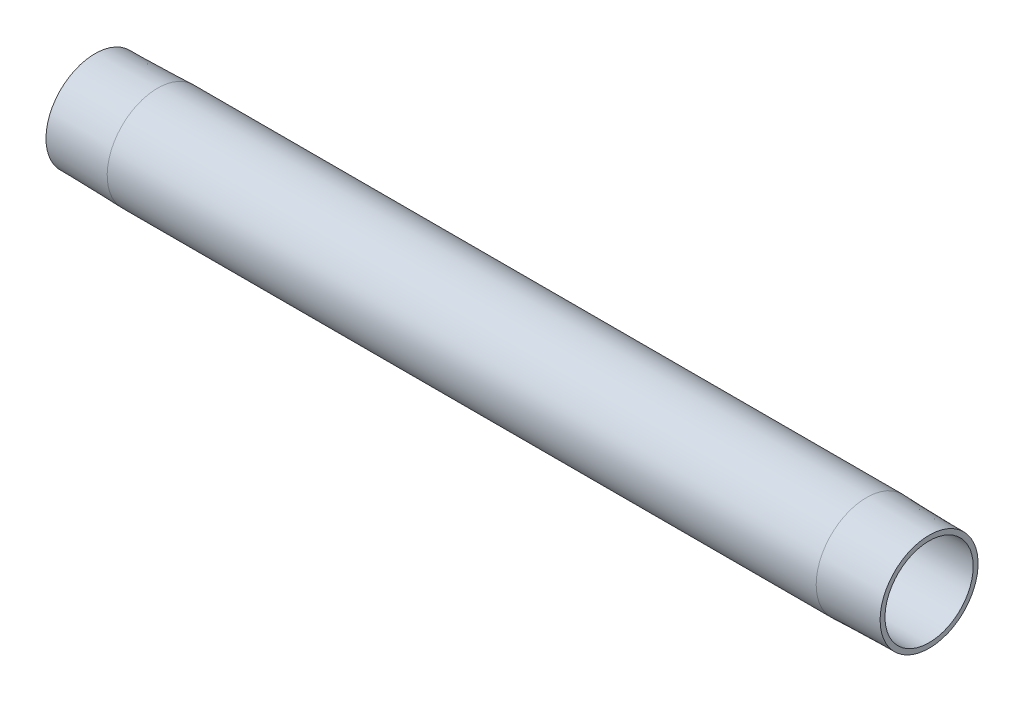
ISO-10303-21;
HEADER;
FILE_DESCRIPTION(('STEP AP214'),'2;1');
FILE_NAME('part.step','',(''),(''),'','','');
FILE_SCHEMA(('AUTOMOTIVE_DESIGN { 1 0 10303 214 1 1 1 1 }'));
ENDSEC;
DATA;
#1=APPLICATION_CONTEXT('core data for automotive mechanical design processes');
#2=APPLICATION_PROTOCOL_DEFINITION('international standard','automotive_design',2000,#1);
#3=PRODUCT_CONTEXT('',#1,'mechanical');
#4=PRODUCT('Part','Part','',(#3));
#5=PRODUCT_RELATED_PRODUCT_CATEGORY('part','',(#4));
#6=PRODUCT_DEFINITION_FORMATION('','',#4);
#7=PRODUCT_DEFINITION_CONTEXT('part definition',#1,'design');
#8=PRODUCT_DEFINITION('design','',#6,#7);
#9=PRODUCT_DEFINITION_SHAPE('','',#8);
#10=(LENGTH_UNIT() NAMED_UNIT(*) SI_UNIT(.MILLI.,.METRE.));
#11=(NAMED_UNIT(*) PLANE_ANGLE_UNIT() SI_UNIT($,.RADIAN.));
#12=(NAMED_UNIT(*) SI_UNIT($,.STERADIAN.) SOLID_ANGLE_UNIT());
#13=UNCERTAINTY_MEASURE_WITH_UNIT(LENGTH_MEASURE(1.E-05),#10,'distance_accuracy_value','');
#14=(GEOMETRIC_REPRESENTATION_CONTEXT(3) GLOBAL_UNCERTAINTY_ASSIGNED_CONTEXT((#13)) GLOBAL_UNIT_ASSIGNED_CONTEXT((#10,
#11,#12)) REPRESENTATION_CONTEXT('',''));
#15=CARTESIAN_POINT('',(0.,0.,0.));
#16=DIRECTION('',(0.,0.,1.));
#17=DIRECTION('',(1.,0.,0.));
#18=AXIS2_PLACEMENT_3D('',#15,#16,#17);
#19=CARTESIAN_POINT('',(-400.,0.,0.));
#20=DIRECTION('',(1.,0.,0.));
#21=DIRECTION('',(0.,0.,-1.));
#22=AXIS2_PLACEMENT_3D('',#19,#20,#21);
#23=CYLINDRICAL_SURFACE('',#22,24.15);
#24=CARTESIAN_POINT('',(-30.,0.,0.));
#25=DIRECTION('',(-1.,0.,0.));
#26=DIRECTION('',(0.,0.,1.));
#27=AXIS2_PLACEMENT_3D('',#24,#25,#26);
#28=CIRCLE('',#27,24.15);
#29=CARTESIAN_POINT('',(-30.,0.,24.15));
#30=VERTEX_POINT('',#29);
#31=EDGE_CURVE('E40',#30,#30,#28,.T.);
#32=ORIENTED_EDGE('',*,*,#31,.T.);
#33=EDGE_LOOP('',(#32));
#34=FACE_BOUND('',#33,.T.);
#35=CARTESIAN_POINT('',(-370.,0.,0.));
#36=DIRECTION('',(-1.,0.,0.));
#37=DIRECTION('',(0.,-1.,0.));
#38=AXIS2_PLACEMENT_3D('',#35,#36,#37);
#39=CIRCLE('',#38,24.15);
#40=CARTESIAN_POINT('',(-370.,-24.15,0.));
#41=VERTEX_POINT('',#40);
#42=EDGE_CURVE('E47',#41,#41,#39,.T.);
#43=ORIENTED_EDGE('',*,*,#42,.F.);
#44=EDGE_LOOP('',(#43));
#45=FACE_BOUND('',#44,.T.);
#46=ADVANCED_FACE('F30',(#34,#45),#23,.T.);
#47=CARTESIAN_POINT('',(-400.,0.,0.));
#48=DIRECTION('',(1.,0.,0.));
#49=DIRECTION('',(0.,0.,-1.));
#50=AXIS2_PLACEMENT_3D('',#47,#48,#49);
#51=PLANE('',#50);
#52=CARTESIAN_POINT('',(-400.,0.,0.));
#53=DIRECTION('',(1.,0.,0.));
#54=DIRECTION('',(0.,0.,-1.));
#55=AXIS2_PLACEMENT_3D('',#52,#53,#54);
#56=CIRCLE('',#55,21.15);
#57=CARTESIAN_POINT('',(-400.,0.,-21.15));
#58=VERTEX_POINT('',#57);
#59=EDGE_CURVE('E10',#58,#58,#56,.T.);
#60=ORIENTED_EDGE('',*,*,#59,.T.);
#61=EDGE_LOOP('',(#60));
#62=FACE_BOUND('',#61,.T.);
#63=CARTESIAN_POINT('',(-400.,0.,0.));
#64=DIRECTION('',(-1.,0.,0.));
#65=DIRECTION('',(0.,-1.,0.));
#66=AXIS2_PLACEMENT_3D('',#63,#64,#65);
#67=CIRCLE('',#66,23.4953976713357);
#68=CARTESIAN_POINT('',(-400.,-23.4953976713357,0.));
#69=VERTEX_POINT('',#68);
#70=EDGE_CURVE('E50',#69,#69,#67,.T.);
#71=ORIENTED_EDGE('',*,*,#70,.T.);
#72=EDGE_LOOP('',(#71));
#73=FACE_BOUND('',#72,.T.);
#74=ADVANCED_FACE('F54',(#62,#73),#51,.F.);
#75=CARTESIAN_POINT('',(0.,0.,0.));
#76=DIRECTION('',(1.,0.,0.));
#77=DIRECTION('',(0.,0.,-1.));
#78=AXIS2_PLACEMENT_3D('',#75,#76,#77);
#79=PLANE('',#78);
#80=CARTESIAN_POINT('',(0.,0.,0.));
#81=DIRECTION('',(1.,0.,0.));
#82=DIRECTION('',(0.,0.,-1.));
#83=AXIS2_PLACEMENT_3D('',#80,#81,#82);
#84=CIRCLE('',#83,21.15);
#85=CARTESIAN_POINT('',(0.,0.,-21.15));
#86=VERTEX_POINT('',#85);
#87=EDGE_CURVE('E33',#86,#86,#84,.T.);
#88=ORIENTED_EDGE('',*,*,#87,.F.);
#89=EDGE_LOOP('',(#88));
#90=FACE_BOUND('',#89,.T.);
#91=CARTESIAN_POINT('',(0.,0.,0.));
#92=DIRECTION('',(-1.,0.,0.));
#93=DIRECTION('',(0.,0.,1.));
#94=AXIS2_PLACEMENT_3D('',#91,#92,#93);
#95=CIRCLE('',#94,23.4953976713357);
#96=CARTESIAN_POINT('',(0.,0.,23.4953976713357));
#97=VERTEX_POINT('',#96);
#98=EDGE_CURVE('E44',#97,#97,#95,.T.);
#99=ORIENTED_EDGE('',*,*,#98,.F.);
#100=EDGE_LOOP('',(#99));
#101=FACE_BOUND('',#100,.T.);
#102=ADVANCED_FACE('F72',(#90,#101),#79,.T.);
#103=CARTESIAN_POINT('',(-400.,0.,0.));
#104=DIRECTION('',(1.,0.,0.));
#105=DIRECTION('',(0.,0.,-1.));
#106=AXIS2_PLACEMENT_3D('',#103,#104,#105);
#107=CYLINDRICAL_SURFACE('',#106,21.15);
#108=ORIENTED_EDGE('',*,*,#59,.F.);
#109=EDGE_LOOP('',(#108));
#110=FACE_BOUND('',#109,.T.);
#111=ORIENTED_EDGE('',*,*,#87,.T.);
#112=EDGE_LOOP('',(#111));
#113=FACE_BOUND('',#112,.T.);
#114=ADVANCED_FACE('F64',(#110,#113),#107,.F.);
#115=CARTESIAN_POINT('',(-30.,0.,0.));
#116=DIRECTION('',(-1.,0.,0.));
#117=DIRECTION('',(0.,0.,1.));
#118=AXIS2_PLACEMENT_3D('',#115,#116,#117);
#119=CONICAL_SURFACE('',#118,24.15,0.0218166156499219);
#120=ORIENTED_EDGE('',*,*,#98,.T.);
#121=EDGE_LOOP('',(#120));
#122=FACE_BOUND('',#121,.T.);
#123=ORIENTED_EDGE('',*,*,#31,.F.);
#124=EDGE_LOOP('',(#123));
#125=FACE_BOUND('',#124,.T.);
#126=ADVANCED_FACE('F58',(#122,#125),#119,.T.);
#127=CARTESIAN_POINT('',(-400.,0.,0.));
#128=DIRECTION('',(1.,0.,0.));
#129=DIRECTION('',(0.,1.,0.));
#130=AXIS2_PLACEMENT_3D('',#127,#128,#129);
#131=CONICAL_SURFACE('',#130,23.4953976713357,0.0218166156499223);
#132=ORIENTED_EDGE('',*,*,#42,.T.);
#133=EDGE_LOOP('',(#132));
#134=FACE_BOUND('',#133,.T.);
#135=ORIENTED_EDGE('',*,*,#70,.F.);
#136=EDGE_LOOP('',(#135));
#137=FACE_BOUND('',#136,.T.);
#138=ADVANCED_FACE('F56',(#134,#137),#131,.T.);
#139=CLOSED_SHELL('',(#46,#74,#102,#114,#126,#138));
#140=MANIFOLD_SOLID_BREP('B2',#139);
#141=ADVANCED_BREP_SHAPE_REPRESENTATION('',(#18,#140),#14);
#142=SHAPE_DEFINITION_REPRESENTATION(#9,#141);
ENDSEC;
END-ISO-10303-21;
